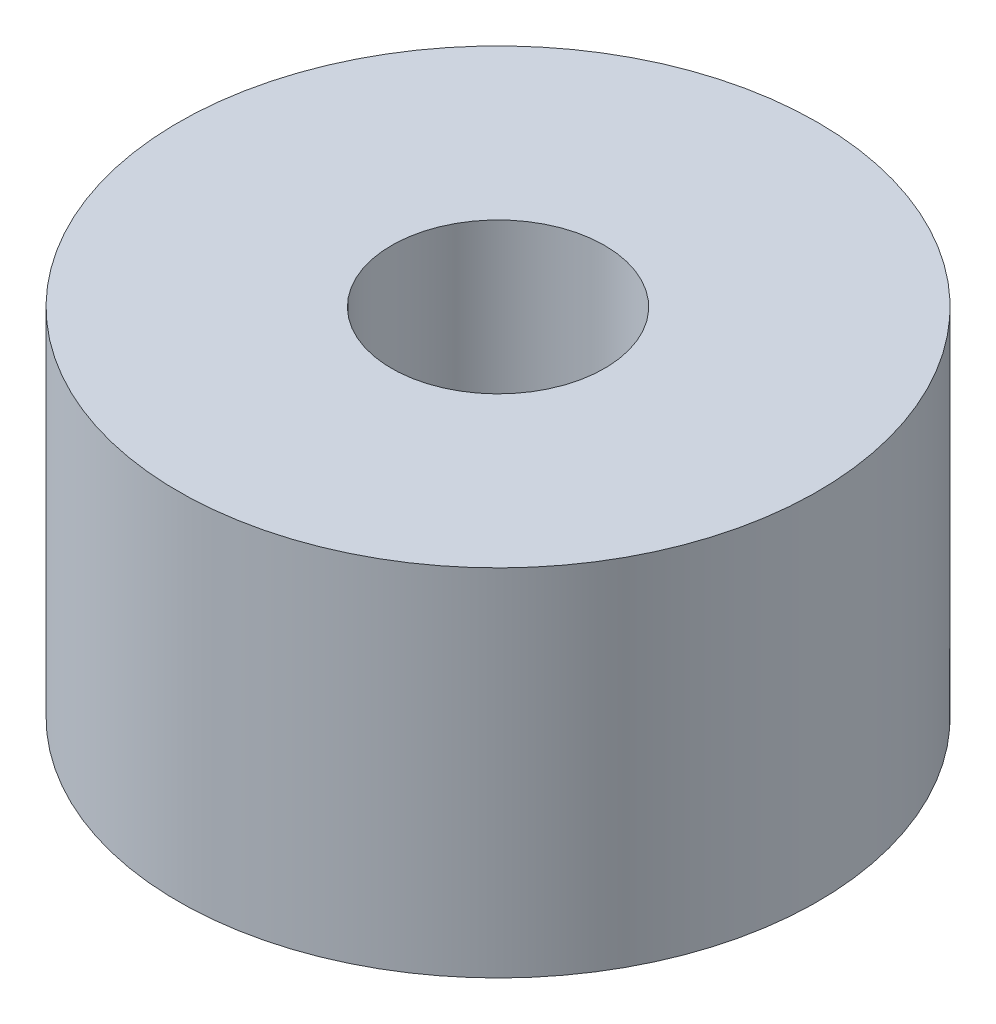
ISO-10303-21;
HEADER;
FILE_DESCRIPTION(('STEP AP214'),'2;1');
FILE_NAME('part.step','',(''),(''),'','','');
FILE_SCHEMA(('AUTOMOTIVE_DESIGN { 1 0 10303 214 1 1 1 1 }'));
ENDSEC;
DATA;
#1=APPLICATION_CONTEXT('core data for automotive mechanical design processes');
#2=APPLICATION_PROTOCOL_DEFINITION('international standard','automotive_design',2000,#1);
#3=PRODUCT_CONTEXT('',#1,'mechanical');
#4=PRODUCT('Part','Part','',(#3));
#5=PRODUCT_RELATED_PRODUCT_CATEGORY('part','',(#4));
#6=PRODUCT_DEFINITION_FORMATION('','',#4);
#7=PRODUCT_DEFINITION_CONTEXT('part definition',#1,'design');
#8=PRODUCT_DEFINITION('design','',#6,#7);
#9=PRODUCT_DEFINITION_SHAPE('','',#8);
#10=(LENGTH_UNIT() NAMED_UNIT(*) SI_UNIT(.MILLI.,.METRE.));
#11=(NAMED_UNIT(*) PLANE_ANGLE_UNIT() SI_UNIT($,.RADIAN.));
#12=(NAMED_UNIT(*) SI_UNIT($,.STERADIAN.) SOLID_ANGLE_UNIT());
#13=UNCERTAINTY_MEASURE_WITH_UNIT(LENGTH_MEASURE(1.E-05),#10,'distance_accuracy_value','');
#14=(GEOMETRIC_REPRESENTATION_CONTEXT(3) GLOBAL_UNCERTAINTY_ASSIGNED_CONTEXT((#13)) GLOBAL_UNIT_ASSIGNED_CONTEXT((#10,
#11,#12)) REPRESENTATION_CONTEXT('',''));
#15=CARTESIAN_POINT('',(0.,0.,0.));
#16=DIRECTION('',(0.,0.,1.));
#17=DIRECTION('',(1.,0.,0.));
#18=AXIS2_PLACEMENT_3D('',#15,#16,#17);
#19=CARTESIAN_POINT('',(0.,5.,0.));
#20=DIRECTION('',(0.,1.,0.));
#21=DIRECTION('',(0.,0.,-1.));
#22=AXIS2_PLACEMENT_3D('',#19,#20,#21);
#23=PLANE('',#22);
#24=CARTESIAN_POINT('',(0.,5.,0.));
#25=DIRECTION('',(0.,-1.,0.));
#26=DIRECTION('',(0.,0.,-1.));
#27=AXIS2_PLACEMENT_3D('',#24,#25,#26);
#28=CIRCLE('',#27,4.5);
#29=CARTESIAN_POINT('',(0.,5.,-4.5));
#30=VERTEX_POINT('',#29);
#31=EDGE_CURVE('E10',#30,#30,#28,.T.);
#32=ORIENTED_EDGE('',*,*,#31,.F.);
#33=EDGE_LOOP('',(#32));
#34=FACE_BOUND('',#33,.T.);
#35=CARTESIAN_POINT('',(0.,5.,0.));
#36=DIRECTION('',(0.,-1.,0.));
#37=DIRECTION('',(0.,0.,-1.));
#38=AXIS2_PLACEMENT_3D('',#35,#36,#37);
#39=CIRCLE('',#38,1.5);
#40=CARTESIAN_POINT('',(0.,5.,-1.5));
#41=VERTEX_POINT('',#40);
#42=EDGE_CURVE('E44',#41,#41,#39,.T.);
#43=ORIENTED_EDGE('',*,*,#42,.T.);
#44=EDGE_LOOP('',(#43));
#45=FACE_BOUND('',#44,.T.);
#46=ADVANCED_FACE('F33',(#34,#45),#23,.T.);
#47=CARTESIAN_POINT('',(0.,0.,0.));
#48=DIRECTION('',(0.,1.,0.));
#49=DIRECTION('',(0.,0.,-1.));
#50=AXIS2_PLACEMENT_3D('',#47,#48,#49);
#51=PLANE('',#50);
#52=CARTESIAN_POINT('',(0.,0.,0.));
#53=DIRECTION('',(0.,-1.,0.));
#54=DIRECTION('',(0.,0.,-1.));
#55=AXIS2_PLACEMENT_3D('',#52,#53,#54);
#56=CIRCLE('',#55,4.5);
#57=CARTESIAN_POINT('',(0.,0.,-4.5));
#58=VERTEX_POINT('',#57);
#59=EDGE_CURVE('E37',#58,#58,#56,.T.);
#60=ORIENTED_EDGE('',*,*,#59,.T.);
#61=EDGE_LOOP('',(#60));
#62=FACE_BOUND('',#61,.T.);
#63=CARTESIAN_POINT('',(0.,0.,0.));
#64=DIRECTION('',(0.,-1.,0.));
#65=DIRECTION('',(0.,0.,-1.));
#66=AXIS2_PLACEMENT_3D('',#63,#64,#65);
#67=CIRCLE('',#66,1.5);
#68=CARTESIAN_POINT('',(0.,0.,-1.5));
#69=VERTEX_POINT('',#68);
#70=EDGE_CURVE('E46',#69,#69,#67,.T.);
#71=ORIENTED_EDGE('',*,*,#70,.F.);
#72=EDGE_LOOP('',(#71));
#73=FACE_BOUND('',#72,.T.);
#74=ADVANCED_FACE('F59',(#62,#73),#51,.F.);
#75=CARTESIAN_POINT('',(0.,5.,0.));
#76=DIRECTION('',(0.,-1.,0.));
#77=DIRECTION('',(0.,0.,1.));
#78=AXIS2_PLACEMENT_3D('',#75,#76,#77);
#79=CYLINDRICAL_SURFACE('',#78,4.5);
#80=ORIENTED_EDGE('',*,*,#31,.T.);
#81=EDGE_LOOP('',(#80));
#82=FACE_BOUND('',#81,.T.);
#83=ORIENTED_EDGE('',*,*,#59,.F.);
#84=EDGE_LOOP('',(#83));
#85=FACE_BOUND('',#84,.T.);
#86=ADVANCED_FACE('F35',(#82,#85),#79,.T.);
#87=CARTESIAN_POINT('',(0.,5.,0.));
#88=DIRECTION('',(0.,-1.,0.));
#89=DIRECTION('',(0.,0.,1.));
#90=AXIS2_PLACEMENT_3D('',#87,#88,#89);
#91=CYLINDRICAL_SURFACE('',#90,1.5);
#92=ORIENTED_EDGE('',*,*,#42,.F.);
#93=EDGE_LOOP('',(#92));
#94=FACE_BOUND('',#93,.T.);
#95=ORIENTED_EDGE('',*,*,#70,.T.);
#96=EDGE_LOOP('',(#95));
#97=FACE_BOUND('',#96,.T.);
#98=ADVANCED_FACE('F53',(#94,#97),#91,.F.);
#99=CLOSED_SHELL('',(#46,#74,#86,#98));
#100=MANIFOLD_SOLID_BREP('B2',#99);
#101=ADVANCED_BREP_SHAPE_REPRESENTATION('',(#18,#100),#14);
#102=SHAPE_DEFINITION_REPRESENTATION(#9,#101);
ENDSEC;
END-ISO-10303-21;
